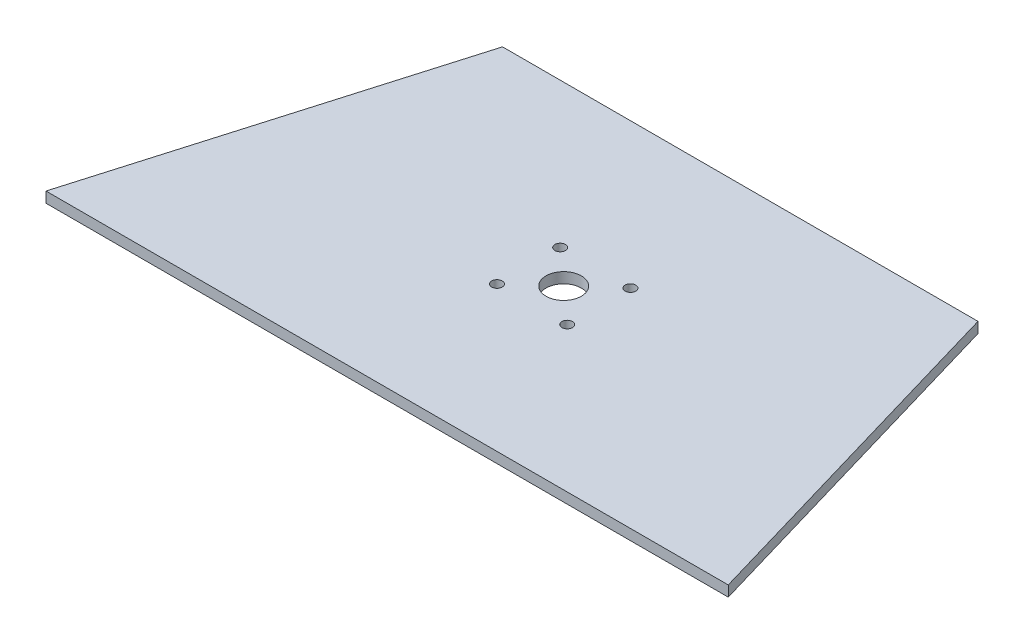
ISO-10303-21;
HEADER;
FILE_DESCRIPTION(('STEP AP214'),'2;1');
FILE_NAME('part.step','',(''),(''),'','','');
FILE_SCHEMA(('AUTOMOTIVE_DESIGN { 1 0 10303 214 1 1 1 1 }'));
ENDSEC;
DATA;
#1=APPLICATION_CONTEXT('core data for automotive mechanical design processes');
#2=APPLICATION_PROTOCOL_DEFINITION('international standard','automotive_design',2000,#1);
#3=PRODUCT_CONTEXT('',#1,'mechanical');
#4=PRODUCT('Part','Part','',(#3));
#5=PRODUCT_RELATED_PRODUCT_CATEGORY('part','',(#4));
#6=PRODUCT_DEFINITION_FORMATION('','',#4);
#7=PRODUCT_DEFINITION_CONTEXT('part definition',#1,'design');
#8=PRODUCT_DEFINITION('design','',#6,#7);
#9=PRODUCT_DEFINITION_SHAPE('','',#8);
#10=(LENGTH_UNIT() NAMED_UNIT(*) SI_UNIT(.MILLI.,.METRE.));
#11=(NAMED_UNIT(*) PLANE_ANGLE_UNIT() SI_UNIT($,.RADIAN.));
#12=(NAMED_UNIT(*) SI_UNIT($,.STERADIAN.) SOLID_ANGLE_UNIT());
#13=UNCERTAINTY_MEASURE_WITH_UNIT(LENGTH_MEASURE(1.E-05),#10,'distance_accuracy_value','');
#14=(GEOMETRIC_REPRESENTATION_CONTEXT(3) GLOBAL_UNCERTAINTY_ASSIGNED_CONTEXT((#13)) GLOBAL_UNIT_ASSIGNED_CONTEXT((#10,
#11,#12)) REPRESENTATION_CONTEXT('',''));
#15=CARTESIAN_POINT('',(0.,0.,0.));
#16=DIRECTION('',(0.,0.,1.));
#17=DIRECTION('',(1.,0.,0.));
#18=AXIS2_PLACEMENT_3D('',#15,#16,#17);
#19=CARTESIAN_POINT('',(-13.2,3.,0.));
#20=DIRECTION('',(0.959707262339068,0.,0.281001727065248));
#21=DIRECTION('',(0.281001727065248,0.,-0.959707262339068));
#22=AXIS2_PLACEMENT_3D('',#19,#20,#21);
#23=PLANE('',#22);
#24=DIRECTION('',(-0.281001727065247,0.,0.959707262339068));
#25=VECTOR('',#24,1.);
#26=CARTESIAN_POINT('',(-13.2,0.,0.));
#27=LINE('',#26,#25);
#28=CARTESIAN_POINT('',(16.0799417168491,0.,-100.));
#29=VERTEX_POINT('',#28);
#30=CARTESIAN_POINT('',(-13.2,0.,0.));
#31=VERTEX_POINT('',#30);
#32=EDGE_CURVE('E103',#29,#31,#27,.T.);
#33=ORIENTED_EDGE('',*,*,#32,.T.);
#34=DIRECTION('',(0.,-1.,0.));
#35=VECTOR('',#34,1.);
#36=CARTESIAN_POINT('',(-13.2,3.,0.));
#37=LINE('',#36,#35);
#38=CARTESIAN_POINT('',(-13.2,3.,0.));
#39=VERTEX_POINT('',#38);
#40=EDGE_CURVE('E11',#39,#31,#37,.T.);
#41=ORIENTED_EDGE('',*,*,#40,.F.);
#42=DIRECTION('',(-0.281001727065247,0.,0.959707262339068));
#43=VECTOR('',#42,1.);
#44=CARTESIAN_POINT('',(-13.2,3.,0.));
#45=LINE('',#44,#43);
#46=CARTESIAN_POINT('',(16.0799417168491,3.,-100.));
#47=VERTEX_POINT('',#46);
#48=EDGE_CURVE('E91',#47,#39,#45,.T.);
#49=ORIENTED_EDGE('',*,*,#48,.F.);
#50=DIRECTION('',(0.,-1.,0.));
#51=VECTOR('',#50,1.);
#52=CARTESIAN_POINT('',(16.0799417168491,3.,-100.));
#53=LINE('',#52,#51);
#54=EDGE_CURVE('E99',#47,#29,#53,.T.);
#55=ORIENTED_EDGE('',*,*,#54,.T.);
#56=EDGE_LOOP('',(#33,#41,#49,#55));
#57=FACE_BOUND('',#56,.T.);
#58=ADVANCED_FACE('F40',(#57),#23,.F.);
#59=CARTESIAN_POINT('',(-13.2,3.,0.));
#60=DIRECTION('',(0.,0.,-1.));
#61=DIRECTION('',(-1.,0.,0.));
#62=AXIS2_PLACEMENT_3D('',#59,#60,#61);
#63=PLANE('',#62);
#64=DIRECTION('',(1.,0.,0.));
#65=VECTOR('',#64,1.);
#66=CARTESIAN_POINT('',(-13.2,0.,0.));
#67=LINE('',#66,#65);
#68=CARTESIAN_POINT('',(180.,0.,0.));
#69=VERTEX_POINT('',#68);
#70=EDGE_CURVE('E95',#31,#69,#67,.T.);
#71=ORIENTED_EDGE('',*,*,#70,.T.);
#72=DIRECTION('',(0.,-1.,0.));
#73=VECTOR('',#72,1.);
#74=CARTESIAN_POINT('',(180.,3.,0.));
#75=LINE('',#74,#73);
#76=CARTESIAN_POINT('',(180.,3.,0.));
#77=VERTEX_POINT('',#76);
#78=EDGE_CURVE('E48',#77,#69,#75,.T.);
#79=ORIENTED_EDGE('',*,*,#78,.F.);
#80=DIRECTION('',(1.,0.,0.));
#81=VECTOR('',#80,1.);
#82=CARTESIAN_POINT('',(-13.2,3.,0.));
#83=LINE('',#82,#81);
#84=EDGE_CURVE('E86',#39,#77,#83,.T.);
#85=ORIENTED_EDGE('',*,*,#84,.F.);
#86=ORIENTED_EDGE('',*,*,#40,.T.);
#87=EDGE_LOOP('',(#71,#79,#85,#86));
#88=FACE_BOUND('',#87,.T.);
#89=ADVANCED_FACE('F94',(#88),#63,.F.);
#90=CARTESIAN_POINT('',(180.,3.,0.));
#91=DIRECTION('',(-0.959707262339066,0.,0.281001727065255));
#92=DIRECTION('',(0.281001727065255,0.,0.959707262339066));
#93=AXIS2_PLACEMENT_3D('',#90,#91,#92);
#94=PLANE('',#93);
#95=DIRECTION('',(-0.281001727065255,0.,-0.959707262339066));
#96=VECTOR('',#95,1.);
#97=CARTESIAN_POINT('',(180.,0.,0.));
#98=LINE('',#97,#96);
#99=CARTESIAN_POINT('',(150.72005828315,0.,-100.));
#100=VERTEX_POINT('',#99);
#101=EDGE_CURVE('E73',#69,#100,#98,.T.);
#102=ORIENTED_EDGE('',*,*,#101,.T.);
#103=DIRECTION('',(0.,-1.,0.));
#104=VECTOR('',#103,1.);
#105=CARTESIAN_POINT('',(150.72005828315,3.,-100.));
#106=LINE('',#105,#104);
#107=CARTESIAN_POINT('',(150.72005828315,3.,-100.));
#108=VERTEX_POINT('',#107);
#109=EDGE_CURVE('E96',#108,#100,#106,.T.);
#110=ORIENTED_EDGE('',*,*,#109,.F.);
#111=DIRECTION('',(-0.281001727065255,0.,-0.959707262339066));
#112=VECTOR('',#111,1.);
#113=CARTESIAN_POINT('',(180.,3.,0.));
#114=LINE('',#113,#112);
#115=EDGE_CURVE('E89',#77,#108,#114,.T.);
#116=ORIENTED_EDGE('',*,*,#115,.F.);
#117=ORIENTED_EDGE('',*,*,#78,.T.);
#118=EDGE_LOOP('',(#102,#110,#116,#117));
#119=FACE_BOUND('',#118,.T.);
#120=ADVANCED_FACE('F97',(#119),#94,.F.);
#121=CARTESIAN_POINT('',(16.0799417168491,3.,-100.));
#122=DIRECTION('',(0.,0.,1.));
#123=DIRECTION('',(1.,0.,0.));
#124=AXIS2_PLACEMENT_3D('',#121,#122,#123);
#125=PLANE('',#124);
#126=DIRECTION('',(-1.,0.,0.));
#127=VECTOR('',#126,1.);
#128=CARTESIAN_POINT('',(16.0799417168491,0.,-100.));
#129=LINE('',#128,#127);
#130=EDGE_CURVE('E79',#100,#29,#129,.T.);
#131=ORIENTED_EDGE('',*,*,#130,.T.);
#132=ORIENTED_EDGE('',*,*,#54,.F.);
#133=DIRECTION('',(-1.,0.,0.));
#134=VECTOR('',#133,1.);
#135=CARTESIAN_POINT('',(16.0799417168491,3.,-100.));
#136=LINE('',#135,#134);
#137=EDGE_CURVE('E56',#108,#47,#136,.T.);
#138=ORIENTED_EDGE('',*,*,#137,.F.);
#139=ORIENTED_EDGE('',*,*,#109,.T.);
#140=EDGE_LOOP('',(#131,#132,#138,#139));
#141=FACE_BOUND('',#140,.T.);
#142=ADVANCED_FACE('F111',(#141),#125,.F.);
#143=CARTESIAN_POINT('',(0.,3.,0.));
#144=DIRECTION('',(0.,-1.,0.));
#145=DIRECTION('',(0.,0.,-1.));
#146=AXIS2_PLACEMENT_3D('',#143,#144,#145);
#147=PLANE('',#146);
#148=CARTESIAN_POINT('',(73.4499999999997,3.,-58.9500000000002));
#149=DIRECTION('',(0.,1.,0.));
#150=DIRECTION('',(0.,0.,1.));
#151=AXIS2_PLACEMENT_3D('',#148,#149,#150);
#152=CIRCLE('',#151,1.5);
#153=CARTESIAN_POINT('',(73.4499999999997,3.,-57.4500000000002));
#154=VERTEX_POINT('',#153);
#155=EDGE_CURVE('E143',#154,#154,#152,.T.);
#156=ORIENTED_EDGE('',*,*,#155,.F.);
#157=EDGE_LOOP('',(#156));
#158=FACE_BOUND('',#157,.T.);
#159=CARTESIAN_POINT('',(73.4499999999997,3.,-41.0500000000002));
#160=DIRECTION('',(0.,1.,0.));
#161=DIRECTION('',(0.,0.,1.));
#162=AXIS2_PLACEMENT_3D('',#159,#160,#161);
#163=CIRCLE('',#162,1.5);
#164=CARTESIAN_POINT('',(73.4499999999997,3.,-39.5500000000002));
#165=VERTEX_POINT('',#164);
#166=EDGE_CURVE('E137',#165,#165,#163,.T.);
#167=ORIENTED_EDGE('',*,*,#166,.F.);
#168=EDGE_LOOP('',(#167));
#169=FACE_BOUND('',#168,.T.);
#170=CARTESIAN_POINT('',(93.3499999999998,3.,-41.0500000000002));
#171=DIRECTION('',(0.,1.,0.));
#172=DIRECTION('',(0.,0.,1.));
#173=AXIS2_PLACEMENT_3D('',#170,#171,#172);
#174=CIRCLE('',#173,1.5);
#175=CARTESIAN_POINT('',(93.3499999999998,3.,-39.5500000000002));
#176=VERTEX_POINT('',#175);
#177=EDGE_CURVE('E131',#176,#176,#174,.T.);
#178=ORIENTED_EDGE('',*,*,#177,.F.);
#179=EDGE_LOOP('',(#178));
#180=FACE_BOUND('',#179,.T.);
#181=CARTESIAN_POINT('',(93.3499999999998,3.,-58.9500000000002));
#182=DIRECTION('',(0.,1.,0.));
#183=DIRECTION('',(0.,0.,1.));
#184=AXIS2_PLACEMENT_3D('',#181,#182,#183);
#185=CIRCLE('',#184,1.5);
#186=CARTESIAN_POINT('',(93.3499999999998,3.,-57.4500000000002));
#187=VERTEX_POINT('',#186);
#188=EDGE_CURVE('E125',#187,#187,#185,.T.);
#189=ORIENTED_EDGE('',*,*,#188,.F.);
#190=EDGE_LOOP('',(#189));
#191=FACE_BOUND('',#190,.T.);
#192=CARTESIAN_POINT('',(83.3999999999997,3.,-50.0000000000002));
#193=DIRECTION('',(0.,1.,0.));
#194=DIRECTION('',(0.,0.,1.));
#195=AXIS2_PLACEMENT_3D('',#192,#193,#194);
#196=CIRCLE('',#195,5.);
#197=CARTESIAN_POINT('',(83.3999999999997,3.,-45.0000000000001));
#198=VERTEX_POINT('',#197);
#199=EDGE_CURVE('E119',#198,#198,#196,.T.);
#200=ORIENTED_EDGE('',*,*,#199,.F.);
#201=EDGE_LOOP('',(#200));
#202=FACE_BOUND('',#201,.T.);
#203=ORIENTED_EDGE('',*,*,#48,.T.);
#204=ORIENTED_EDGE('',*,*,#84,.T.);
#205=ORIENTED_EDGE('',*,*,#115,.T.);
#206=ORIENTED_EDGE('',*,*,#137,.T.);
#207=EDGE_LOOP('',(#203,#204,#205,#206));
#208=FACE_BOUND('',#207,.T.);
#209=ADVANCED_FACE('F87',(#158,#169,#180,#191,#202,#208),#147,.F.);
#210=CARTESIAN_POINT('',(0.,0.,0.));
#211=DIRECTION('',(0.,-1.,0.));
#212=DIRECTION('',(0.,0.,-1.));
#213=AXIS2_PLACEMENT_3D('',#210,#211,#212);
#214=PLANE('',#213);
#215=CARTESIAN_POINT('',(73.4499999999997,0.,-58.9500000000002));
#216=DIRECTION('',(0.,-1.,0.));
#217=DIRECTION('',(0.,0.,-1.));
#218=AXIS2_PLACEMENT_3D('',#215,#216,#217);
#219=CIRCLE('',#218,1.5);
#220=CARTESIAN_POINT('',(73.4499999999997,0.,-60.4500000000002));
#221=VERTEX_POINT('',#220);
#222=EDGE_CURVE('E140',#221,#221,#219,.T.);
#223=ORIENTED_EDGE('',*,*,#222,.F.);
#224=EDGE_LOOP('',(#223));
#225=FACE_BOUND('',#224,.T.);
#226=CARTESIAN_POINT('',(73.4499999999997,0.,-41.0500000000002));
#227=DIRECTION('',(0.,-1.,0.));
#228=DIRECTION('',(0.,0.,-1.));
#229=AXIS2_PLACEMENT_3D('',#226,#227,#228);
#230=CIRCLE('',#229,1.5);
#231=CARTESIAN_POINT('',(73.4499999999997,0.,-42.5500000000002));
#232=VERTEX_POINT('',#231);
#233=EDGE_CURVE('E134',#232,#232,#230,.T.);
#234=ORIENTED_EDGE('',*,*,#233,.F.);
#235=EDGE_LOOP('',(#234));
#236=FACE_BOUND('',#235,.T.);
#237=CARTESIAN_POINT('',(93.3499999999998,0.,-41.0500000000002));
#238=DIRECTION('',(0.,-1.,0.));
#239=DIRECTION('',(0.,0.,-1.));
#240=AXIS2_PLACEMENT_3D('',#237,#238,#239);
#241=CIRCLE('',#240,1.5);
#242=CARTESIAN_POINT('',(93.3499999999998,0.,-42.5500000000002));
#243=VERTEX_POINT('',#242);
#244=EDGE_CURVE('E128',#243,#243,#241,.T.);
#245=ORIENTED_EDGE('',*,*,#244,.F.);
#246=EDGE_LOOP('',(#245));
#247=FACE_BOUND('',#246,.T.);
#248=CARTESIAN_POINT('',(93.3499999999998,0.,-58.9500000000002));
#249=DIRECTION('',(0.,-1.,0.));
#250=DIRECTION('',(0.,0.,-1.));
#251=AXIS2_PLACEMENT_3D('',#248,#249,#250);
#252=CIRCLE('',#251,1.5);
#253=CARTESIAN_POINT('',(93.3499999999998,0.,-60.4500000000002));
#254=VERTEX_POINT('',#253);
#255=EDGE_CURVE('E122',#254,#254,#252,.T.);
#256=ORIENTED_EDGE('',*,*,#255,.F.);
#257=EDGE_LOOP('',(#256));
#258=FACE_BOUND('',#257,.T.);
#259=CARTESIAN_POINT('',(83.3999999999997,0.,-50.0000000000002));
#260=DIRECTION('',(0.,-1.,0.));
#261=DIRECTION('',(0.,0.,-1.));
#262=AXIS2_PLACEMENT_3D('',#259,#260,#261);
#263=CIRCLE('',#262,5.);
#264=CARTESIAN_POINT('',(83.3999999999997,0.,-55.0000000000002));
#265=VERTEX_POINT('',#264);
#266=EDGE_CURVE('E106',#265,#265,#263,.T.);
#267=ORIENTED_EDGE('',*,*,#266,.F.);
#268=EDGE_LOOP('',(#267));
#269=FACE_BOUND('',#268,.T.);
#270=ORIENTED_EDGE('',*,*,#32,.F.);
#271=ORIENTED_EDGE('',*,*,#130,.F.);
#272=ORIENTED_EDGE('',*,*,#101,.F.);
#273=ORIENTED_EDGE('',*,*,#70,.F.);
#274=EDGE_LOOP('',(#270,#271,#272,#273));
#275=FACE_BOUND('',#274,.T.);
#276=ADVANCED_FACE('F114',(#225,#236,#247,#258,#269,#275),#214,.T.);
#277=CARTESIAN_POINT('',(83.3999999999997,3.,-50.0000000000002));
#278=DIRECTION('',(0.,1.,0.));
#279=DIRECTION('',(0.,0.,1.));
#280=AXIS2_PLACEMENT_3D('',#277,#278,#279);
#281=CYLINDRICAL_SURFACE('',#280,5.);
#282=ORIENTED_EDGE('',*,*,#199,.T.);
#283=EDGE_LOOP('',(#282));
#284=FACE_BOUND('',#283,.T.);
#285=ORIENTED_EDGE('',*,*,#266,.T.);
#286=EDGE_LOOP('',(#285));
#287=FACE_BOUND('',#286,.T.);
#288=ADVANCED_FACE('F161',(#284,#287),#281,.F.);
#289=CARTESIAN_POINT('',(93.3499999999998,3.,-58.9500000000002));
#290=DIRECTION('',(0.,1.,0.));
#291=DIRECTION('',(0.,0.,1.));
#292=AXIS2_PLACEMENT_3D('',#289,#290,#291);
#293=CYLINDRICAL_SURFACE('',#292,1.5);
#294=ORIENTED_EDGE('',*,*,#188,.T.);
#295=EDGE_LOOP('',(#294));
#296=FACE_BOUND('',#295,.T.);
#297=ORIENTED_EDGE('',*,*,#255,.T.);
#298=EDGE_LOOP('',(#297));
#299=FACE_BOUND('',#298,.T.);
#300=ADVANCED_FACE('F164',(#296,#299),#293,.F.);
#301=CARTESIAN_POINT('',(93.3499999999998,3.,-41.0500000000002));
#302=DIRECTION('',(0.,1.,0.));
#303=DIRECTION('',(0.,0.,1.));
#304=AXIS2_PLACEMENT_3D('',#301,#302,#303);
#305=CYLINDRICAL_SURFACE('',#304,1.5);
#306=ORIENTED_EDGE('',*,*,#177,.T.);
#307=EDGE_LOOP('',(#306));
#308=FACE_BOUND('',#307,.T.);
#309=ORIENTED_EDGE('',*,*,#244,.T.);
#310=EDGE_LOOP('',(#309));
#311=FACE_BOUND('',#310,.T.);
#312=ADVANCED_FACE('F209',(#308,#311),#305,.F.);
#313=CARTESIAN_POINT('',(73.4499999999997,3.,-41.0500000000002));
#314=DIRECTION('',(0.,1.,0.));
#315=DIRECTION('',(0.,0.,1.));
#316=AXIS2_PLACEMENT_3D('',#313,#314,#315);
#317=CYLINDRICAL_SURFACE('',#316,1.5);
#318=ORIENTED_EDGE('',*,*,#166,.T.);
#319=EDGE_LOOP('',(#318));
#320=FACE_BOUND('',#319,.T.);
#321=ORIENTED_EDGE('',*,*,#233,.T.);
#322=EDGE_LOOP('',(#321));
#323=FACE_BOUND('',#322,.T.);
#324=ADVANCED_FACE('F219',(#320,#323),#317,.F.);
#325=CARTESIAN_POINT('',(73.4499999999997,3.,-58.9500000000002));
#326=DIRECTION('',(0.,1.,0.));
#327=DIRECTION('',(0.,0.,1.));
#328=AXIS2_PLACEMENT_3D('',#325,#326,#327);
#329=CYLINDRICAL_SURFACE('',#328,1.5);
#330=ORIENTED_EDGE('',*,*,#155,.T.);
#331=EDGE_LOOP('',(#330));
#332=FACE_BOUND('',#331,.T.);
#333=ORIENTED_EDGE('',*,*,#222,.T.);
#334=EDGE_LOOP('',(#333));
#335=FACE_BOUND('',#334,.T.);
#336=ADVANCED_FACE('F147',(#332,#335),#329,.F.);
#337=CLOSED_SHELL('',(#58,#89,#120,#142,#209,#276,#288,#300,#312,#324,#336));
#338=MANIFOLD_SOLID_BREP('B2',#337);
#339=ADVANCED_BREP_SHAPE_REPRESENTATION('',(#18,#338),#14);
#340=SHAPE_DEFINITION_REPRESENTATION(#9,#339);
ENDSEC;
END-ISO-10303-21;
